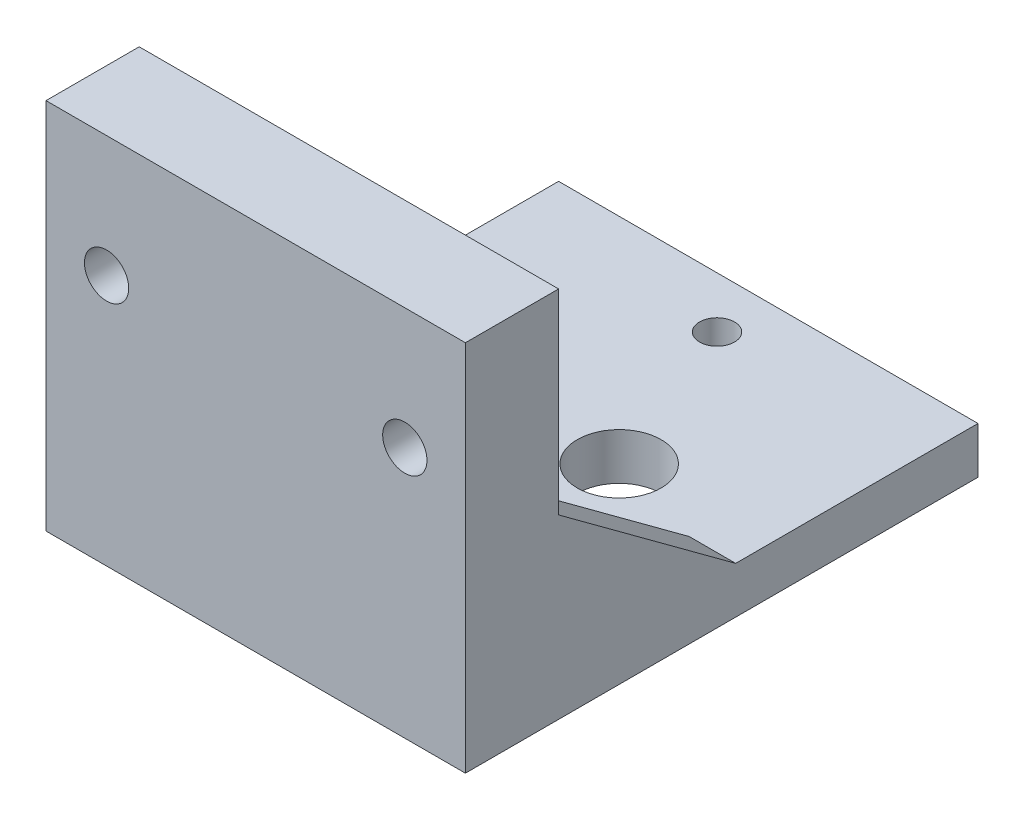
ISO-10303-21;
HEADER;
FILE_DESCRIPTION(('STEP AP214'),'2;1');
FILE_NAME('part.step','',(''),(''),'','','');
FILE_SCHEMA(('AUTOMOTIVE_DESIGN { 1 0 10303 214 1 1 1 1 }'));
ENDSEC;
DATA;
#1=APPLICATION_CONTEXT('core data for automotive mechanical design processes');
#2=APPLICATION_PROTOCOL_DEFINITION('international standard','automotive_design',2000,#1);
#3=PRODUCT_CONTEXT('',#1,'mechanical');
#4=PRODUCT('Part','Part','',(#3));
#5=PRODUCT_RELATED_PRODUCT_CATEGORY('part','',(#4));
#6=PRODUCT_DEFINITION_FORMATION('','',#4);
#7=PRODUCT_DEFINITION_CONTEXT('part definition',#1,'design');
#8=PRODUCT_DEFINITION('design','',#6,#7);
#9=PRODUCT_DEFINITION_SHAPE('','',#8);
#10=(LENGTH_UNIT() NAMED_UNIT(*) SI_UNIT(.MILLI.,.METRE.));
#11=(NAMED_UNIT(*) PLANE_ANGLE_UNIT() SI_UNIT($,.RADIAN.));
#12=(NAMED_UNIT(*) SI_UNIT($,.STERADIAN.) SOLID_ANGLE_UNIT());
#13=UNCERTAINTY_MEASURE_WITH_UNIT(LENGTH_MEASURE(1.E-05),#10,'distance_accuracy_value','');
#14=(GEOMETRIC_REPRESENTATION_CONTEXT(3) GLOBAL_UNCERTAINTY_ASSIGNED_CONTEXT((#13)) GLOBAL_UNIT_ASSIGNED_CONTEXT((#10,
#11,#12)) REPRESENTATION_CONTEXT('',''));
#15=CARTESIAN_POINT('',(0.,0.,0.));
#16=DIRECTION('',(0.,0.,1.));
#17=DIRECTION('',(1.,0.,0.));
#18=AXIS2_PLACEMENT_3D('',#15,#16,#17);
#19=CARTESIAN_POINT('',(0.,5.,0.));
#20=DIRECTION('',(0.,1.,0.));
#21=DIRECTION('',(0.,0.,1.));
#22=AXIS2_PLACEMENT_3D('',#19,#20,#21);
#23=PLANE('',#22);
#24=CARTESIAN_POINT('',(5.75628954535205,5.,136.050969125864));
#25=DIRECTION('',(0.,1.,0.));
#26=DIRECTION('',(0.,0.,1.));
#27=AXIS2_PLACEMENT_3D('',#24,#25,#26);
#28=CIRCLE('',#27,1.875);
#29=CARTESIAN_POINT('',(5.75628954535205,5.,137.925969125864));
#30=VERTEX_POINT('',#29);
#31=EDGE_CURVE('E183',#30,#30,#28,.T.);
#32=ORIENTED_EDGE('',*,*,#31,.F.);
#33=EDGE_LOOP('',(#32));
#34=FACE_BOUND('',#33,.T.);
#35=CARTESIAN_POINT('',(5.75628954535205,5.,101.050969125864));
#36=DIRECTION('',(0.,1.,0.));
#37=DIRECTION('',(0.,0.,1.));
#38=AXIS2_PLACEMENT_3D('',#35,#36,#37);
#39=CIRCLE('',#38,1.875);
#40=CARTESIAN_POINT('',(5.75628954535205,5.,102.925969125864));
#41=VERTEX_POINT('',#40);
#42=EDGE_CURVE('E186',#41,#41,#39,.T.);
#43=ORIENTED_EDGE('',*,*,#42,.F.);
#44=EDGE_LOOP('',(#43));
#45=FACE_BOUND('',#44,.T.);
#46=CARTESIAN_POINT('',(12.756289545352,5.,118.550969125864));
#47=DIRECTION('',(0.,1.,0.));
#48=DIRECTION('',(0.,0.,1.));
#49=AXIS2_PLACEMENT_3D('',#46,#47,#48);
#50=CIRCLE('',#49,4.50000000000002);
#51=CARTESIAN_POINT('',(12.756289545352,5.,123.050969125864));
#52=VERTEX_POINT('',#51);
#53=EDGE_CURVE('E200',#52,#52,#50,.T.);
#54=ORIENTED_EDGE('',*,*,#53,.F.);
#55=EDGE_LOOP('',(#54));
#56=FACE_BOUND('',#55,.T.);
#57=DIRECTION('',(0.,0.,1.));
#58=VECTOR('',#57,1.);
#59=CARTESIAN_POINT('',(23.2562895453521,5.,140.550969125864));
#60=LINE('',#59,#58);
#61=CARTESIAN_POINT('',(23.2562895453521,5.,121.550969125864));
#62=VERTEX_POINT('',#61);
#63=CARTESIAN_POINT('',(23.2562895453521,5.,140.550969125864));
#64=VERTEX_POINT('',#63);
#65=EDGE_CURVE('E52',#62,#64,#60,.T.);
#66=ORIENTED_EDGE('',*,*,#65,.F.);
#67=DIRECTION('',(1.,0.,0.));
#68=VECTOR('',#67,1.);
#69=CARTESIAN_POINT('',(23.2562895453521,5.,121.550969125864));
#70=LINE('',#69,#68);
#71=CARTESIAN_POINT('',(28.2562895453521,5.,121.550969125864));
#72=VERTEX_POINT('',#71);
#73=EDGE_CURVE('E57',#62,#72,#70,.T.);
#74=ORIENTED_EDGE('',*,*,#73,.T.);
#75=DIRECTION('',(0.,0.,1.));
#76=VECTOR('',#75,1.);
#77=CARTESIAN_POINT('',(28.256289545352,5.,0.));
#78=LINE('',#77,#76);
#79=CARTESIAN_POINT('',(28.2562895453521,5.,95.550969125864));
#80=VERTEX_POINT('',#79);
#81=EDGE_CURVE('E198',#80,#72,#78,.T.);
#82=ORIENTED_EDGE('',*,*,#81,.F.);
#83=DIRECTION('',(-1.,0.,0.));
#84=VECTOR('',#83,1.);
#85=CARTESIAN_POINT('',(0.,5.,95.550969125864));
#86=LINE('',#85,#84);
#87=CARTESIAN_POINT('',(-16.7437104546479,5.,95.550969125864));
#88=VERTEX_POINT('',#87);
#89=EDGE_CURVE('E190',#80,#88,#86,.T.);
#90=ORIENTED_EDGE('',*,*,#89,.T.);
#91=DIRECTION('',(0.,0.,1.));
#92=VECTOR('',#91,1.);
#93=CARTESIAN_POINT('',(-16.7437104546479,5.,0.));
#94=LINE('',#93,#92);
#95=CARTESIAN_POINT('',(-16.743710454648,5.,121.550969125864));
#96=VERTEX_POINT('',#95);
#97=EDGE_CURVE('E193',#88,#96,#94,.T.);
#98=ORIENTED_EDGE('',*,*,#97,.T.);
#99=DIRECTION('',(-1.,0.,0.));
#100=VECTOR('',#99,1.);
#101=CARTESIAN_POINT('',(-11.743710454648,5.,121.550969125864));
#102=LINE('',#101,#100);
#103=CARTESIAN_POINT('',(-11.743710454648,5.,121.550969125864));
#104=VERTEX_POINT('',#103);
#105=EDGE_CURVE('E171',#104,#96,#102,.T.);
#106=ORIENTED_EDGE('',*,*,#105,.F.);
#107=DIRECTION('',(0.,0.,1.));
#108=VECTOR('',#107,1.);
#109=CARTESIAN_POINT('',(-11.743710454648,5.,140.550969125864));
#110=LINE('',#109,#108);
#111=CARTESIAN_POINT('',(-11.743710454648,5.,140.550969125864));
#112=VERTEX_POINT('',#111);
#113=EDGE_CURVE('E165',#104,#112,#110,.T.);
#114=ORIENTED_EDGE('',*,*,#113,.T.);
#115=DIRECTION('',(-1.,0.,0.));
#116=VECTOR('',#115,1.);
#117=CARTESIAN_POINT('',(0.,5.,140.550969125864));
#118=LINE('',#117,#116);
#119=EDGE_CURVE('E196',#64,#112,#118,.T.);
#120=ORIENTED_EDGE('',*,*,#119,.F.);
#121=EDGE_LOOP('',(#66,#74,#82,#90,#98,#106,#114,#120));
#122=FACE_BOUND('',#121,.T.);
#123=ADVANCED_FACE('F37',(#34,#45,#56,#122),#23,.T.);
#124=CARTESIAN_POINT('',(0.,40.,140.550969125864));
#125=DIRECTION('',(0.,0.,1.));
#126=DIRECTION('',(1.,0.,0.));
#127=AXIS2_PLACEMENT_3D('',#124,#125,#126);
#128=PLANE('',#127);
#129=CARTESIAN_POINT('',(21.756289545352,27.,140.550969125864));
#130=DIRECTION('',(0.,0.,1.));
#131=DIRECTION('',(1.,0.,0.));
#132=AXIS2_PLACEMENT_3D('',#129,#130,#131);
#133=CIRCLE('',#132,2.375);
#134=CARTESIAN_POINT('',(24.131289545352,27.,140.550969125864));
#135=VERTEX_POINT('',#134);
#136=EDGE_CURVE('E141',#135,#135,#133,.F.);
#137=ORIENTED_EDGE('',*,*,#136,.F.);
#138=EDGE_LOOP('',(#137));
#139=FACE_BOUND('',#138,.T.);
#140=CARTESIAN_POINT('',(-10.243710454648,27.,140.550969125864));
#141=DIRECTION('',(0.,0.,1.));
#142=DIRECTION('',(1.,0.,0.));
#143=AXIS2_PLACEMENT_3D('',#140,#141,#142);
#144=CIRCLE('',#143,2.375);
#145=CARTESIAN_POINT('',(-7.86871045464796,27.,140.550969125864));
#146=VERTEX_POINT('',#145);
#147=EDGE_CURVE('E393',#146,#146,#144,.F.);
#148=ORIENTED_EDGE('',*,*,#147,.F.);
#149=EDGE_LOOP('',(#148));
#150=FACE_BOUND('',#149,.T.);
#151=DIRECTION('',(1.,0.,0.));
#152=VECTOR('',#151,1.);
#153=CARTESIAN_POINT('',(23.2562895453521,19.,140.550969125864));
#154=LINE('',#153,#152);
#155=CARTESIAN_POINT('',(23.2562895453521,19.,140.550969125864));
#156=VERTEX_POINT('',#155);
#157=CARTESIAN_POINT('',(28.2562895453521,19.,140.550969125864));
#158=VERTEX_POINT('',#157);
#159=EDGE_CURVE('E154',#156,#158,#154,.T.);
#160=ORIENTED_EDGE('',*,*,#159,.F.);
#161=DIRECTION('',(0.,1.,0.));
#162=VECTOR('',#161,1.);
#163=CARTESIAN_POINT('',(23.2562895453521,19.,140.550969125864));
#164=LINE('',#163,#162);
#165=EDGE_CURVE('E145',#64,#156,#164,.T.);
#166=ORIENTED_EDGE('',*,*,#165,.F.);
#167=ORIENTED_EDGE('',*,*,#119,.T.);
#168=DIRECTION('',(0.,1.,0.));
#169=VECTOR('',#168,1.);
#170=CARTESIAN_POINT('',(-11.743710454648,19.,140.550969125864));
#171=LINE('',#170,#169);
#172=CARTESIAN_POINT('',(-11.743710454648,19.,140.550969125864));
#173=VERTEX_POINT('',#172);
#174=EDGE_CURVE('E159',#112,#173,#171,.T.);
#175=ORIENTED_EDGE('',*,*,#174,.T.);
#176=DIRECTION('',(-1.,0.,0.));
#177=VECTOR('',#176,1.);
#178=CARTESIAN_POINT('',(-11.743710454648,19.,140.550969125864));
#179=LINE('',#178,#177);
#180=CARTESIAN_POINT('',(-16.743710454648,19.,140.550969125864));
#181=VERTEX_POINT('',#180);
#182=EDGE_CURVE('E168',#173,#181,#179,.T.);
#183=ORIENTED_EDGE('',*,*,#182,.T.);
#184=DIRECTION('',(0.,-1.,0.));
#185=VECTOR('',#184,1.);
#186=CARTESIAN_POINT('',(-16.7437104546479,40.,140.550969125864));
#187=LINE('',#186,#185);
#188=CARTESIAN_POINT('',(-16.7437104546479,40.,140.550969125864));
#189=VERTEX_POINT('',#188);
#190=EDGE_CURVE('E179',#189,#181,#187,.T.);
#191=ORIENTED_EDGE('',*,*,#190,.F.);
#192=DIRECTION('',(-1.,0.,0.));
#193=VECTOR('',#192,1.);
#194=CARTESIAN_POINT('',(0.,40.,140.550969125864));
#195=LINE('',#194,#193);
#196=CARTESIAN_POINT('',(28.2562895453521,40.,140.550969125864));
#197=VERTEX_POINT('',#196);
#198=EDGE_CURVE('E173',#197,#189,#195,.T.);
#199=ORIENTED_EDGE('',*,*,#198,.F.);
#200=DIRECTION('',(0.,-1.,0.));
#201=VECTOR('',#200,1.);
#202=CARTESIAN_POINT('',(28.2562895453521,40.,140.550969125864));
#203=LINE('',#202,#201);
#204=EDGE_CURVE('E123',#197,#158,#203,.T.);
#205=ORIENTED_EDGE('',*,*,#204,.T.);
#206=EDGE_LOOP('',(#160,#166,#167,#175,#183,#191,#199,#205));
#207=FACE_BOUND('',#206,.T.);
#208=ADVANCED_FACE('F231',(#139,#150,#207),#128,.F.);
#209=CARTESIAN_POINT('',(0.,5.,95.550969125864));
#210=DIRECTION('',(0.,0.,1.));
#211=DIRECTION('',(1.,0.,0.));
#212=AXIS2_PLACEMENT_3D('',#209,#210,#211);
#213=PLANE('',#212);
#214=DIRECTION('',(-1.,0.,0.));
#215=VECTOR('',#214,1.);
#216=CARTESIAN_POINT('',(0.,0.,95.550969125864));
#217=LINE('',#216,#215);
#218=CARTESIAN_POINT('',(28.2562895453521,0.,95.550969125864));
#219=VERTEX_POINT('',#218);
#220=CARTESIAN_POINT('',(-16.7437104546479,0.,95.550969125864));
#221=VERTEX_POINT('',#220);
#222=EDGE_CURVE('E208',#219,#221,#217,.T.);
#223=ORIENTED_EDGE('',*,*,#222,.T.);
#224=DIRECTION('',(0.,-1.,0.));
#225=VECTOR('',#224,1.);
#226=CARTESIAN_POINT('',(-16.7437104546479,5.,95.550969125864));
#227=LINE('',#226,#225);
#228=EDGE_CURVE('E11',#88,#221,#227,.T.);
#229=ORIENTED_EDGE('',*,*,#228,.F.);
#230=ORIENTED_EDGE('',*,*,#89,.F.);
#231=DIRECTION('',(0.,-1.,0.));
#232=VECTOR('',#231,1.);
#233=CARTESIAN_POINT('',(28.2562895453521,5.,95.550969125864));
#234=LINE('',#233,#232);
#235=EDGE_CURVE('E45',#80,#219,#234,.T.);
#236=ORIENTED_EDGE('',*,*,#235,.T.);
#237=EDGE_LOOP('',(#223,#229,#230,#236));
#238=FACE_BOUND('',#237,.T.);
#239=ADVANCED_FACE('F219',(#238),#213,.F.);
#240=CARTESIAN_POINT('',(-16.7437104546479,5.,0.));
#241=DIRECTION('',(1.,0.,0.));
#242=DIRECTION('',(0.,0.,-1.));
#243=AXIS2_PLACEMENT_3D('',#240,#241,#242);
#244=PLANE('',#243);
#245=DIRECTION('',(0.,0.,1.));
#246=VECTOR('',#245,1.);
#247=CARTESIAN_POINT('',(-16.7437104546479,0.,0.));
#248=LINE('',#247,#246);
#249=CARTESIAN_POINT('',(-16.7437104546479,0.,150.550969125864));
#250=VERTEX_POINT('',#249);
#251=EDGE_CURVE('E211',#221,#250,#248,.T.);
#252=ORIENTED_EDGE('',*,*,#251,.T.);
#253=DIRECTION('',(0.,-1.,0.));
#254=VECTOR('',#253,1.);
#255=CARTESIAN_POINT('',(-16.7437104546479,85.7055795281058,150.550969125864));
#256=LINE('',#255,#254);
#257=CARTESIAN_POINT('',(-16.7437104546479,40.,150.550969125864));
#258=VERTEX_POINT('',#257);
#259=EDGE_CURVE('E135',#258,#250,#256,.T.);
#260=ORIENTED_EDGE('',*,*,#259,.F.);
#261=DIRECTION('',(0.,0.,1.));
#262=VECTOR('',#261,1.);
#263=CARTESIAN_POINT('',(-16.7437104546479,40.,0.));
#264=LINE('',#263,#262);
#265=EDGE_CURVE('E127',#189,#258,#264,.T.);
#266=ORIENTED_EDGE('',*,*,#265,.F.);
#267=ORIENTED_EDGE('',*,*,#190,.T.);
#268=DIRECTION('',(0.,-0.59319903804985,-0.805055837353368));
#269=VECTOR('',#268,1.);
#270=CARTESIAN_POINT('',(-16.743710454648,5.,121.550969125864));
#271=LINE('',#270,#269);
#272=EDGE_CURVE('E157',#181,#96,#271,.T.);
#273=ORIENTED_EDGE('',*,*,#272,.T.);
#274=ORIENTED_EDGE('',*,*,#97,.F.);
#275=ORIENTED_EDGE('',*,*,#228,.T.);
#276=EDGE_LOOP('',(#252,#260,#266,#267,#273,#274,#275));
#277=FACE_BOUND('',#276,.T.);
#278=ADVANCED_FACE('F225',(#277),#244,.F.);
#279=CARTESIAN_POINT('',(28.256289545352,5.,0.));
#280=DIRECTION('',(1.,0.,0.));
#281=DIRECTION('',(0.,0.,-1.));
#282=AXIS2_PLACEMENT_3D('',#279,#280,#281);
#283=PLANE('',#282);
#284=DIRECTION('',(0.,0.,1.));
#285=VECTOR('',#284,1.);
#286=CARTESIAN_POINT('',(28.256289545352,0.,0.));
#287=LINE('',#286,#285);
#288=CARTESIAN_POINT('',(28.256289545352,0.,150.550969125864));
#289=VERTEX_POINT('',#288);
#290=EDGE_CURVE('E213',#219,#289,#287,.T.);
#291=ORIENTED_EDGE('',*,*,#290,.F.);
#292=ORIENTED_EDGE('',*,*,#235,.F.);
#293=ORIENTED_EDGE('',*,*,#81,.T.);
#294=DIRECTION('',(0.,-0.59319903804985,-0.805055837353368));
#295=VECTOR('',#294,1.);
#296=CARTESIAN_POINT('',(28.2562895453521,5.,121.550969125864));
#297=LINE('',#296,#295);
#298=EDGE_CURVE('E148',#158,#72,#297,.T.);
#299=ORIENTED_EDGE('',*,*,#298,.F.);
#300=ORIENTED_EDGE('',*,*,#204,.F.);
#301=DIRECTION('',(0.,0.,1.));
#302=VECTOR('',#301,1.);
#303=CARTESIAN_POINT('',(28.256289545352,40.,0.));
#304=LINE('',#303,#302);
#305=CARTESIAN_POINT('',(28.256289545352,40.,150.550969125864));
#306=VERTEX_POINT('',#305);
#307=EDGE_CURVE('E115',#197,#306,#304,.T.);
#308=ORIENTED_EDGE('',*,*,#307,.T.);
#309=DIRECTION('',(0.,-1.,0.));
#310=VECTOR('',#309,1.);
#311=CARTESIAN_POINT('',(28.256289545352,85.7055795281058,150.550969125864));
#312=LINE('',#311,#310);
#313=EDGE_CURVE('E120',#306,#289,#312,.T.);
#314=ORIENTED_EDGE('',*,*,#313,.T.);
#315=EDGE_LOOP('',(#291,#292,#293,#299,#300,#308,#314));
#316=FACE_BOUND('',#315,.T.);
#317=ADVANCED_FACE('F118',(#316),#283,.T.);
#318=CARTESIAN_POINT('',(5.75628954535205,5.,101.050969125864));
#319=DIRECTION('',(0.,-1.,0.));
#320=DIRECTION('',(0.,0.,-1.));
#321=AXIS2_PLACEMENT_3D('',#318,#319,#320);
#322=CYLINDRICAL_SURFACE('',#321,1.875);
#323=ORIENTED_EDGE('',*,*,#42,.T.);
#324=EDGE_LOOP('',(#323));
#325=FACE_BOUND('',#324,.T.);
#326=CARTESIAN_POINT('',(5.75628954535205,0.,101.050969125864));
#327=DIRECTION('',(0.,1.,0.));
#328=DIRECTION('',(0.,0.,1.));
#329=AXIS2_PLACEMENT_3D('',#326,#327,#328);
#330=CIRCLE('',#329,1.875);
#331=CARTESIAN_POINT('',(5.75628954535205,0.,102.925969125864));
#332=VERTEX_POINT('',#331);
#333=EDGE_CURVE('E205',#332,#332,#330,.T.);
#334=ORIENTED_EDGE('',*,*,#333,.F.);
#335=EDGE_LOOP('',(#334));
#336=FACE_BOUND('',#335,.T.);
#337=ADVANCED_FACE('F272',(#325,#336),#322,.F.);
#338=CARTESIAN_POINT('',(5.75628954535205,5.,136.050969125864));
#339=DIRECTION('',(0.,-1.,0.));
#340=DIRECTION('',(0.,0.,-1.));
#341=AXIS2_PLACEMENT_3D('',#338,#339,#340);
#342=CYLINDRICAL_SURFACE('',#341,1.875);
#343=ORIENTED_EDGE('',*,*,#31,.T.);
#344=EDGE_LOOP('',(#343));
#345=FACE_BOUND('',#344,.T.);
#346=CARTESIAN_POINT('',(5.75628954535205,0.,136.050969125864));
#347=DIRECTION('',(0.,1.,0.));
#348=DIRECTION('',(0.,0.,1.));
#349=AXIS2_PLACEMENT_3D('',#346,#347,#348);
#350=CIRCLE('',#349,1.875);
#351=CARTESIAN_POINT('',(5.75628954535205,0.,137.925969125864));
#352=VERTEX_POINT('',#351);
#353=EDGE_CURVE('E182',#352,#352,#350,.T.);
#354=ORIENTED_EDGE('',*,*,#353,.F.);
#355=EDGE_LOOP('',(#354));
#356=FACE_BOUND('',#355,.T.);
#357=ADVANCED_FACE('F39',(#345,#356),#342,.F.);
#358=CARTESIAN_POINT('',(12.756289545352,5.,118.550969125864));
#359=DIRECTION('',(0.,-1.,0.));
#360=DIRECTION('',(0.,0.,-1.));
#361=AXIS2_PLACEMENT_3D('',#358,#359,#360);
#362=CYLINDRICAL_SURFACE('',#361,4.50000000000002);
#363=ORIENTED_EDGE('',*,*,#53,.T.);
#364=EDGE_LOOP('',(#363));
#365=FACE_BOUND('',#364,.T.);
#366=CARTESIAN_POINT('',(12.756289545352,0.,118.550969125864));
#367=DIRECTION('',(0.,1.,0.));
#368=DIRECTION('',(0.,0.,1.));
#369=AXIS2_PLACEMENT_3D('',#366,#367,#368);
#370=CIRCLE('',#369,4.50000000000002);
#371=CARTESIAN_POINT('',(12.756289545352,0.,123.050969125864));
#372=VERTEX_POINT('',#371);
#373=EDGE_CURVE('E187',#372,#372,#370,.T.);
#374=ORIENTED_EDGE('',*,*,#373,.F.);
#375=EDGE_LOOP('',(#374));
#376=FACE_BOUND('',#375,.T.);
#377=ADVANCED_FACE('F265',(#365,#376),#362,.F.);
#378=CARTESIAN_POINT('',(0.,0.,0.));
#379=DIRECTION('',(0.,1.,0.));
#380=DIRECTION('',(0.,0.,1.));
#381=AXIS2_PLACEMENT_3D('',#378,#379,#380);
#382=PLANE('',#381);
#383=ORIENTED_EDGE('',*,*,#353,.T.);
#384=EDGE_LOOP('',(#383));
#385=FACE_BOUND('',#384,.T.);
#386=ORIENTED_EDGE('',*,*,#333,.T.);
#387=EDGE_LOOP('',(#386));
#388=FACE_BOUND('',#387,.T.);
#389=ORIENTED_EDGE('',*,*,#222,.F.);
#390=ORIENTED_EDGE('',*,*,#290,.T.);
#391=DIRECTION('',(-1.,0.,0.));
#392=VECTOR('',#391,1.);
#393=CARTESIAN_POINT('',(0.,0.,150.550969125864));
#394=LINE('',#393,#392);
#395=EDGE_CURVE('E139',#289,#250,#394,.T.);
#396=ORIENTED_EDGE('',*,*,#395,.T.);
#397=ORIENTED_EDGE('',*,*,#251,.F.);
#398=EDGE_LOOP('',(#389,#390,#396,#397));
#399=FACE_BOUND('',#398,.T.);
#400=ORIENTED_EDGE('',*,*,#373,.T.);
#401=EDGE_LOOP('',(#400));
#402=FACE_BOUND('',#401,.T.);
#403=ADVANCED_FACE('F222',(#385,#388,#399,#402),#382,.F.);
#404=CARTESIAN_POINT('',(0.,40.,0.));
#405=DIRECTION('',(0.,1.,0.));
#406=DIRECTION('',(0.,0.,1.));
#407=AXIS2_PLACEMENT_3D('',#404,#405,#406);
#408=PLANE('',#407);
#409=ORIENTED_EDGE('',*,*,#198,.T.);
#410=ORIENTED_EDGE('',*,*,#265,.T.);
#411=DIRECTION('',(-1.,0.,0.));
#412=VECTOR('',#411,1.);
#413=CARTESIAN_POINT('',(0.,40.,150.550969125864));
#414=LINE('',#413,#412);
#415=EDGE_CURVE('E130',#306,#258,#414,.T.);
#416=ORIENTED_EDGE('',*,*,#415,.F.);
#417=ORIENTED_EDGE('',*,*,#307,.F.);
#418=EDGE_LOOP('',(#409,#410,#416,#417));
#419=FACE_BOUND('',#418,.T.);
#420=ADVANCED_FACE('F131',(#419),#408,.T.);
#421=CARTESIAN_POINT('',(-11.743710454648,5.,121.550969125864));
#422=DIRECTION('',(0.,0.805055837353368,-0.59319903804985));
#423=DIRECTION('',(0.,0.59319903804985,0.805055837353368));
#424=AXIS2_PLACEMENT_3D('',#421,#422,#423);
#425=PLANE('',#424);
#426=ORIENTED_EDGE('',*,*,#272,.F.);
#427=ORIENTED_EDGE('',*,*,#182,.F.);
#428=DIRECTION('',(0.,-0.59319903804985,-0.805055837353368));
#429=VECTOR('',#428,1.);
#430=CARTESIAN_POINT('',(-11.743710454648,5.,121.550969125864));
#431=LINE('',#430,#429);
#432=EDGE_CURVE('E162',#173,#104,#431,.T.);
#433=ORIENTED_EDGE('',*,*,#432,.T.);
#434=ORIENTED_EDGE('',*,*,#105,.T.);
#435=EDGE_LOOP('',(#426,#427,#433,#434));
#436=FACE_BOUND('',#435,.T.);
#437=ADVANCED_FACE('F236',(#436),#425,.T.);
#438=CARTESIAN_POINT('',(-11.743710454648,0.,0.));
#439=DIRECTION('',(1.,0.,0.));
#440=DIRECTION('',(0.,0.,-1.));
#441=AXIS2_PLACEMENT_3D('',#438,#439,#440);
#442=PLANE('',#441);
#443=ORIENTED_EDGE('',*,*,#174,.F.);
#444=ORIENTED_EDGE('',*,*,#113,.F.);
#445=ORIENTED_EDGE('',*,*,#432,.F.);
#446=EDGE_LOOP('',(#443,#444,#445));
#447=FACE_BOUND('',#446,.T.);
#448=ADVANCED_FACE('F238',(#447),#442,.T.);
#449=CARTESIAN_POINT('',(23.2562895453521,5.,121.550969125864));
#450=DIRECTION('',(0.,-0.805055837353368,0.59319903804985));
#451=DIRECTION('',(0.,-0.59319903804985,-0.805055837353368));
#452=AXIS2_PLACEMENT_3D('',#449,#450,#451);
#453=PLANE('',#452);
#454=ORIENTED_EDGE('',*,*,#298,.T.);
#455=ORIENTED_EDGE('',*,*,#73,.F.);
#456=DIRECTION('',(0.,-0.59319903804985,-0.805055837353368));
#457=VECTOR('',#456,1.);
#458=CARTESIAN_POINT('',(23.2562895453521,5.,121.550969125864));
#459=LINE('',#458,#457);
#460=EDGE_CURVE('E150',#156,#62,#459,.T.);
#461=ORIENTED_EDGE('',*,*,#460,.F.);
#462=ORIENTED_EDGE('',*,*,#159,.T.);
#463=EDGE_LOOP('',(#454,#455,#461,#462));
#464=FACE_BOUND('',#463,.T.);
#465=ADVANCED_FACE('F228',(#464),#453,.F.);
#466=CARTESIAN_POINT('',(23.256289545352,0.,0.));
#467=DIRECTION('',(-1.,0.,0.));
#468=DIRECTION('',(0.,0.,-1.));
#469=AXIS2_PLACEMENT_3D('',#466,#467,#468);
#470=PLANE('',#469);
#471=ORIENTED_EDGE('',*,*,#165,.T.);
#472=ORIENTED_EDGE('',*,*,#460,.T.);
#473=ORIENTED_EDGE('',*,*,#65,.T.);
#474=EDGE_LOOP('',(#471,#472,#473));
#475=FACE_BOUND('',#474,.T.);
#476=ADVANCED_FACE('F240',(#475),#470,.T.);
#477=CARTESIAN_POINT('',(0.,85.7055795281058,150.550969125864));
#478=DIRECTION('',(0.,0.,1.));
#479=DIRECTION('',(1.,0.,0.));
#480=AXIS2_PLACEMENT_3D('',#477,#478,#479);
#481=PLANE('',#480);
#482=CARTESIAN_POINT('',(21.756289545352,27.,150.550969125864));
#483=DIRECTION('',(0.,0.,1.));
#484=DIRECTION('',(1.,0.,0.));
#485=AXIS2_PLACEMENT_3D('',#482,#483,#484);
#486=CIRCLE('',#485,2.375);
#487=CARTESIAN_POINT('',(24.131289545352,27.,150.550969125864));
#488=VERTEX_POINT('',#487);
#489=EDGE_CURVE('E390',#488,#488,#486,.T.);
#490=ORIENTED_EDGE('',*,*,#489,.F.);
#491=EDGE_LOOP('',(#490));
#492=FACE_BOUND('',#491,.T.);
#493=CARTESIAN_POINT('',(-10.243710454648,27.,150.550969125864));
#494=DIRECTION('',(0.,0.,1.));
#495=DIRECTION('',(1.,0.,0.));
#496=AXIS2_PLACEMENT_3D('',#493,#494,#495);
#497=CIRCLE('',#496,2.375);
#498=CARTESIAN_POINT('',(-7.86871045464796,27.,150.550969125864));
#499=VERTEX_POINT('',#498);
#500=EDGE_CURVE('E398',#499,#499,#497,.T.);
#501=ORIENTED_EDGE('',*,*,#500,.F.);
#502=EDGE_LOOP('',(#501));
#503=FACE_BOUND('',#502,.T.);
#504=ORIENTED_EDGE('',*,*,#313,.F.);
#505=ORIENTED_EDGE('',*,*,#415,.T.);
#506=ORIENTED_EDGE('',*,*,#259,.T.);
#507=ORIENTED_EDGE('',*,*,#395,.F.);
#508=EDGE_LOOP('',(#504,#505,#506,#507));
#509=FACE_BOUND('',#508,.T.);
#510=ADVANCED_FACE('F137',(#492,#503,#509),#481,.T.);
#511=CARTESIAN_POINT('',(-10.243710454648,27.,150.550969125864));
#512=DIRECTION('',(0.,0.,-1.));
#513=DIRECTION('',(-1.,0.,0.));
#514=AXIS2_PLACEMENT_3D('',#511,#512,#513);
#515=CYLINDRICAL_SURFACE('',#514,2.375);
#516=ORIENTED_EDGE('',*,*,#500,.T.);
#517=EDGE_LOOP('',(#516));
#518=FACE_BOUND('',#517,.T.);
#519=ORIENTED_EDGE('',*,*,#147,.T.);
#520=EDGE_LOOP('',(#519));
#521=FACE_BOUND('',#520,.T.);
#522=ADVANCED_FACE('F247',(#518,#521),#515,.F.);
#523=CARTESIAN_POINT('',(21.756289545352,27.,150.550969125864));
#524=DIRECTION('',(0.,0.,-1.));
#525=DIRECTION('',(-1.,0.,0.));
#526=AXIS2_PLACEMENT_3D('',#523,#524,#525);
#527=CYLINDRICAL_SURFACE('',#526,2.375);
#528=ORIENTED_EDGE('',*,*,#489,.T.);
#529=EDGE_LOOP('',(#528));
#530=FACE_BOUND('',#529,.T.);
#531=ORIENTED_EDGE('',*,*,#136,.T.);
#532=EDGE_LOOP('',(#531));
#533=FACE_BOUND('',#532,.T.);
#534=ADVANCED_FACE('F373',(#530,#533),#527,.F.);
#535=CLOSED_SHELL('',(#123,#208,#239,#278,#317,#337,#357,#377,#403,#420,#437,#448,#465,#476,
#510,#522,#534));
#536=MANIFOLD_SOLID_BREP('B2',#535);
#537=ADVANCED_BREP_SHAPE_REPRESENTATION('',(#18,#536),#14);
#538=SHAPE_DEFINITION_REPRESENTATION(#9,#537);
ENDSEC;
END-ISO-10303-21;
